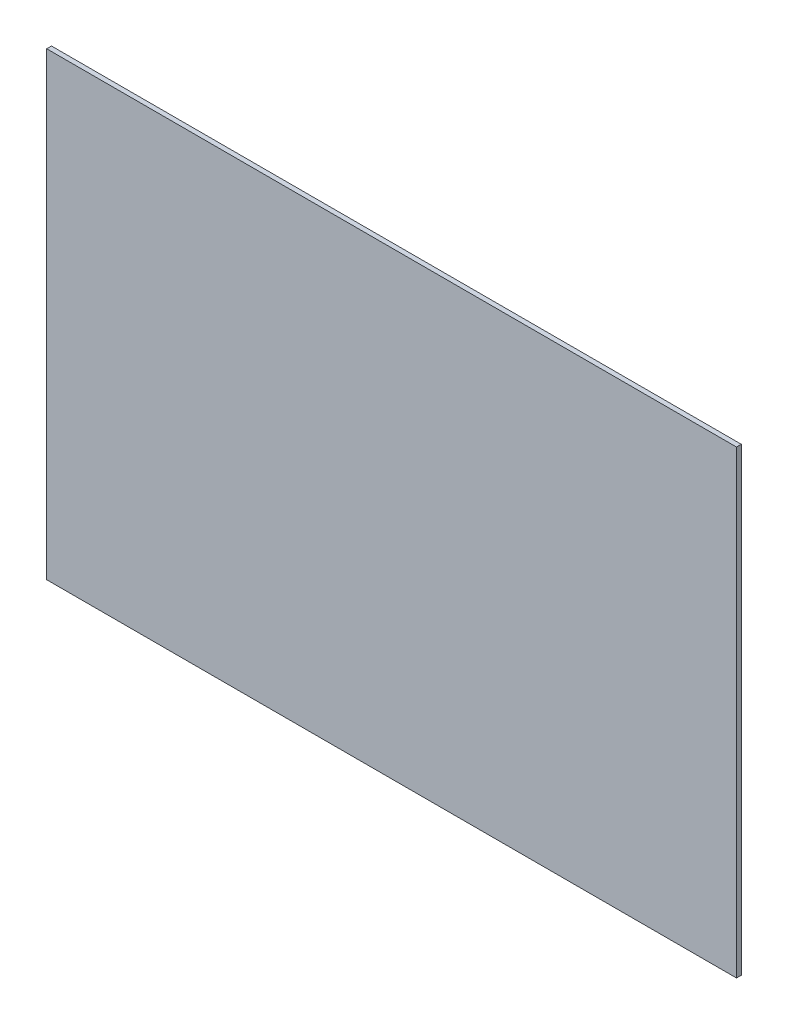
ISO-10303-21;
HEADER;
FILE_DESCRIPTION(('STEP AP214'),'2;1');
FILE_NAME('part.step','',(''),(''),'','','');
FILE_SCHEMA(('AUTOMOTIVE_DESIGN { 1 0 10303 214 1 1 1 1 }'));
ENDSEC;
DATA;
#1=APPLICATION_CONTEXT('core data for automotive mechanical design processes');
#2=APPLICATION_PROTOCOL_DEFINITION('international standard','automotive_design',2000,#1);
#3=PRODUCT_CONTEXT('',#1,'mechanical');
#4=PRODUCT('Part','Part','',(#3));
#5=PRODUCT_RELATED_PRODUCT_CATEGORY('part','',(#4));
#6=PRODUCT_DEFINITION_FORMATION('','',#4);
#7=PRODUCT_DEFINITION_CONTEXT('part definition',#1,'design');
#8=PRODUCT_DEFINITION('design','',#6,#7);
#9=PRODUCT_DEFINITION_SHAPE('','',#8);
#10=(LENGTH_UNIT() NAMED_UNIT(*) SI_UNIT(.MILLI.,.METRE.));
#11=(NAMED_UNIT(*) PLANE_ANGLE_UNIT() SI_UNIT($,.RADIAN.));
#12=(NAMED_UNIT(*) SI_UNIT($,.STERADIAN.) SOLID_ANGLE_UNIT());
#13=UNCERTAINTY_MEASURE_WITH_UNIT(LENGTH_MEASURE(1.E-05),#10,'distance_accuracy_value','');
#14=(GEOMETRIC_REPRESENTATION_CONTEXT(3) GLOBAL_UNCERTAINTY_ASSIGNED_CONTEXT((#13)) GLOBAL_UNIT_ASSIGNED_CONTEXT((#10,
#11,#12)) REPRESENTATION_CONTEXT('',''));
#15=CARTESIAN_POINT('',(0.,0.,0.));
#16=DIRECTION('',(0.,0.,1.));
#17=DIRECTION('',(1.,0.,0.));
#18=AXIS2_PLACEMENT_3D('',#15,#16,#17);
#19=CARTESIAN_POINT('',(-257.487051482059,166.546333853354,3.175));
#20=DIRECTION('',(1.,0.,0.));
#21=DIRECTION('',(0.,1.,0.));
#22=AXIS2_PLACEMENT_3D('',#19,#20,#21);
#23=PLANE('',#22);
#24=DIRECTION('',(0.,-1.,0.));
#25=VECTOR('',#24,1.);
#26=CARTESIAN_POINT('',(-257.487051482059,166.546333853354,0.));
#27=LINE('',#26,#25);
#28=CARTESIAN_POINT('',(-257.487051482059,166.546333853354,0.));
#29=VERTEX_POINT('',#28);
#30=CARTESIAN_POINT('',(-257.487051482059,-138.253666146646,0.));
#31=VERTEX_POINT('',#30);
#32=EDGE_CURVE('E112',#29,#31,#27,.T.);
#33=ORIENTED_EDGE('',*,*,#32,.T.);
#34=DIRECTION('',(0.,0.,-1.));
#35=VECTOR('',#34,1.);
#36=CARTESIAN_POINT('',(-257.487051482059,-138.253666146646,3.175));
#37=LINE('',#36,#35);
#38=CARTESIAN_POINT('',(-257.487051482059,-138.253666146646,3.175));
#39=VERTEX_POINT('',#38);
#40=EDGE_CURVE('E11',#39,#31,#37,.T.);
#41=ORIENTED_EDGE('',*,*,#40,.F.);
#42=DIRECTION('',(0.,-1.,0.));
#43=VECTOR('',#42,1.);
#44=CARTESIAN_POINT('',(-257.487051482059,166.546333853354,3.175));
#45=LINE('',#44,#43);
#46=CARTESIAN_POINT('',(-257.487051482059,166.546333853354,3.175));
#47=VERTEX_POINT('',#46);
#48=EDGE_CURVE('E96',#47,#39,#45,.T.);
#49=ORIENTED_EDGE('',*,*,#48,.F.);
#50=DIRECTION('',(0.,0.,-1.));
#51=VECTOR('',#50,1.);
#52=CARTESIAN_POINT('',(-257.487051482059,166.546333853354,3.175));
#53=LINE('',#52,#51);
#54=EDGE_CURVE('E108',#47,#29,#53,.T.);
#55=ORIENTED_EDGE('',*,*,#54,.T.);
#56=EDGE_LOOP('',(#33,#41,#49,#55));
#57=FACE_BOUND('',#56,.T.);
#58=ADVANCED_FACE('F44',(#57),#23,.F.);
#59=CARTESIAN_POINT('',(-257.487051482059,-138.253666146646,3.175));
#60=DIRECTION('',(0.,1.,0.));
#61=DIRECTION('',(0.,0.,1.));
#62=AXIS2_PLACEMENT_3D('',#59,#60,#61);
#63=PLANE('',#62);
#64=DIRECTION('',(1.,0.,0.));
#65=VECTOR('',#64,1.);
#66=CARTESIAN_POINT('',(-257.487051482059,-138.253666146646,0.));
#67=LINE('',#66,#65);
#68=CARTESIAN_POINT('',(199.712948517941,-138.253666146646,0.));
#69=VERTEX_POINT('',#68);
#70=EDGE_CURVE('E101',#31,#69,#67,.T.);
#71=ORIENTED_EDGE('',*,*,#70,.T.);
#72=DIRECTION('',(0.,0.,-1.));
#73=VECTOR('',#72,1.);
#74=CARTESIAN_POINT('',(199.712948517941,-138.253666146646,3.175));
#75=LINE('',#74,#73);
#76=CARTESIAN_POINT('',(199.712948517941,-138.253666146646,3.175));
#77=VERTEX_POINT('',#76);
#78=EDGE_CURVE('E53',#77,#69,#75,.T.);
#79=ORIENTED_EDGE('',*,*,#78,.F.);
#80=DIRECTION('',(1.,0.,0.));
#81=VECTOR('',#80,1.);
#82=CARTESIAN_POINT('',(-257.487051482059,-138.253666146646,3.175));
#83=LINE('',#82,#81);
#84=EDGE_CURVE('E91',#39,#77,#83,.T.);
#85=ORIENTED_EDGE('',*,*,#84,.F.);
#86=ORIENTED_EDGE('',*,*,#40,.T.);
#87=EDGE_LOOP('',(#71,#79,#85,#86));
#88=FACE_BOUND('',#87,.T.);
#89=ADVANCED_FACE('F100',(#88),#63,.F.);
#90=CARTESIAN_POINT('',(199.712948517941,166.546333853354,3.175));
#91=DIRECTION('',(-1.,0.,0.));
#92=DIRECTION('',(0.,0.,1.));
#93=AXIS2_PLACEMENT_3D('',#90,#91,#92);
#94=PLANE('',#93);
#95=DIRECTION('',(0.,1.,0.));
#96=VECTOR('',#95,1.);
#97=CARTESIAN_POINT('',(199.712948517941,166.546333853354,0.));
#98=LINE('',#97,#96);
#99=CARTESIAN_POINT('',(199.712948517941,166.546333853354,0.));
#100=VERTEX_POINT('',#99);
#101=EDGE_CURVE('E78',#69,#100,#98,.T.);
#102=ORIENTED_EDGE('',*,*,#101,.T.);
#103=DIRECTION('',(0.,0.,-1.));
#104=VECTOR('',#103,1.);
#105=CARTESIAN_POINT('',(199.712948517941,166.546333853354,3.175));
#106=LINE('',#105,#104);
#107=CARTESIAN_POINT('',(199.712948517941,166.546333853354,3.175));
#108=VERTEX_POINT('',#107);
#109=EDGE_CURVE('E103',#108,#100,#106,.T.);
#110=ORIENTED_EDGE('',*,*,#109,.F.);
#111=DIRECTION('',(0.,1.,0.));
#112=VECTOR('',#111,1.);
#113=CARTESIAN_POINT('',(199.712948517941,166.546333853354,3.175));
#114=LINE('',#113,#112);
#115=EDGE_CURVE('E94',#77,#108,#114,.T.);
#116=ORIENTED_EDGE('',*,*,#115,.F.);
#117=ORIENTED_EDGE('',*,*,#78,.T.);
#118=EDGE_LOOP('',(#102,#110,#116,#117));
#119=FACE_BOUND('',#118,.T.);
#120=ADVANCED_FACE('F104',(#119),#94,.F.);
#121=CARTESIAN_POINT('',(-257.487051482059,166.546333853354,3.175));
#122=DIRECTION('',(0.,-1.,0.));
#123=DIRECTION('',(0.,0.,-1.));
#124=AXIS2_PLACEMENT_3D('',#121,#122,#123);
#125=PLANE('',#124);
#126=DIRECTION('',(-1.,0.,0.));
#127=VECTOR('',#126,1.);
#128=CARTESIAN_POINT('',(-257.487051482059,166.546333853354,0.));
#129=LINE('',#128,#127);
#130=EDGE_CURVE('E84',#100,#29,#129,.T.);
#131=ORIENTED_EDGE('',*,*,#130,.T.);
#132=ORIENTED_EDGE('',*,*,#54,.F.);
#133=DIRECTION('',(-1.,0.,0.));
#134=VECTOR('',#133,1.);
#135=CARTESIAN_POINT('',(-257.487051482059,166.546333853354,3.175));
#136=LINE('',#135,#134);
#137=EDGE_CURVE('E61',#108,#47,#136,.T.);
#138=ORIENTED_EDGE('',*,*,#137,.F.);
#139=ORIENTED_EDGE('',*,*,#109,.T.);
#140=EDGE_LOOP('',(#131,#132,#138,#139));
#141=FACE_BOUND('',#140,.T.);
#142=ADVANCED_FACE('F125',(#141),#125,.F.);
#143=CARTESIAN_POINT('',(0.,0.,3.175));
#144=DIRECTION('',(0.,0.,1.));
#145=DIRECTION('',(1.,0.,0.));
#146=AXIS2_PLACEMENT_3D('',#143,#144,#145);
#147=PLANE('',#146);
#148=ORIENTED_EDGE('',*,*,#48,.T.);
#149=ORIENTED_EDGE('',*,*,#84,.T.);
#150=ORIENTED_EDGE('',*,*,#115,.T.);
#151=ORIENTED_EDGE('',*,*,#137,.T.);
#152=EDGE_LOOP('',(#148,#149,#150,#151));
#153=FACE_BOUND('',#152,.T.);
#154=ADVANCED_FACE('F92',(#153),#147,.T.);
#155=CARTESIAN_POINT('',(0.,0.,0.));
#156=DIRECTION('',(0.,0.,1.));
#157=DIRECTION('',(1.,0.,0.));
#158=AXIS2_PLACEMENT_3D('',#155,#156,#157);
#159=PLANE('',#158);
#160=ORIENTED_EDGE('',*,*,#32,.F.);
#161=ORIENTED_EDGE('',*,*,#130,.F.);
#162=ORIENTED_EDGE('',*,*,#101,.F.);
#163=ORIENTED_EDGE('',*,*,#70,.F.);
#164=EDGE_LOOP('',(#160,#161,#162,#163));
#165=FACE_BOUND('',#164,.T.);
#166=ADVANCED_FACE('F128',(#165),#159,.F.);
#167=CLOSED_SHELL('',(#58,#89,#120,#142,#154,#166));
#168=MANIFOLD_SOLID_BREP('B2',#167);
#169=ADVANCED_BREP_SHAPE_REPRESENTATION('',(#18,#168),#14);
#170=SHAPE_DEFINITION_REPRESENTATION(#9,#169);
ENDSEC;
END-ISO-10303-21;
